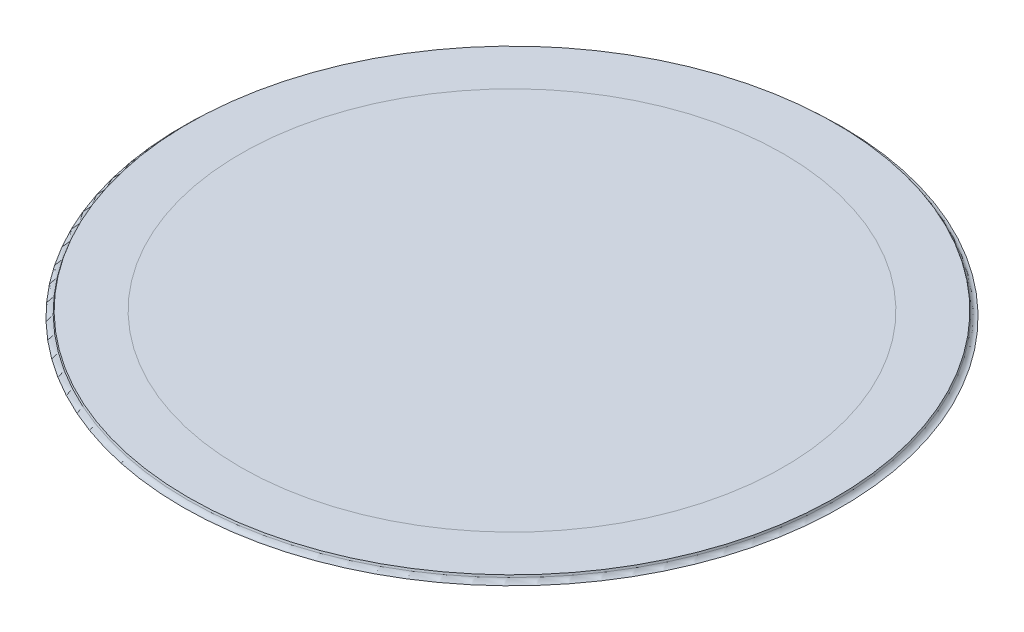
ISO-10303-21;
HEADER;
FILE_DESCRIPTION(('STEP AP214'),'2;1');
FILE_NAME('part.step','',(''),(''),'','','');
FILE_SCHEMA(('AUTOMOTIVE_DESIGN { 1 0 10303 214 1 1 1 1 }'));
ENDSEC;
DATA;
#1=APPLICATION_CONTEXT('core data for automotive mechanical design processes');
#2=APPLICATION_PROTOCOL_DEFINITION('international standard','automotive_design',2000,#1);
#3=PRODUCT_CONTEXT('',#1,'mechanical');
#4=PRODUCT('Part','Part','',(#3));
#5=PRODUCT_RELATED_PRODUCT_CATEGORY('part','',(#4));
#6=PRODUCT_DEFINITION_FORMATION('','',#4);
#7=PRODUCT_DEFINITION_CONTEXT('part definition',#1,'design');
#8=PRODUCT_DEFINITION('design','',#6,#7);
#9=PRODUCT_DEFINITION_SHAPE('','',#8);
#10=(LENGTH_UNIT() NAMED_UNIT(*) SI_UNIT(.MILLI.,.METRE.));
#11=(NAMED_UNIT(*) PLANE_ANGLE_UNIT() SI_UNIT($,.RADIAN.));
#12=(NAMED_UNIT(*) SI_UNIT($,.STERADIAN.) SOLID_ANGLE_UNIT());
#13=UNCERTAINTY_MEASURE_WITH_UNIT(LENGTH_MEASURE(1.E-05),#10,'distance_accuracy_value','');
#14=(GEOMETRIC_REPRESENTATION_CONTEXT(3) GLOBAL_UNCERTAINTY_ASSIGNED_CONTEXT((#13)) GLOBAL_UNIT_ASSIGNED_CONTEXT((#10,
#11,#12)) REPRESENTATION_CONTEXT('',''));
#15=CARTESIAN_POINT('',(0.,0.,0.));
#16=DIRECTION('',(0.,0.,1.));
#17=DIRECTION('',(1.,0.,0.));
#18=AXIS2_PLACEMENT_3D('',#15,#16,#17);
#19=CARTESIAN_POINT('',(0.,0.,35.));
#20=DIRECTION('',(0.,1.,0.));
#21=DIRECTION('',(0.,0.,1.));
#22=AXIS2_PLACEMENT_3D('',#19,#20,#21);
#23=PLANE('',#22);
#24=CARTESIAN_POINT('',(0.,0.,0.));
#25=DIRECTION('',(0.,1.,0.));
#26=DIRECTION('',(0.,0.,1.));
#27=AXIS2_PLACEMENT_3D('',#24,#25,#26);
#28=CIRCLE('',#27,30.3501037691049);
#29=CARTESIAN_POINT('',(0.,0.,30.3501037691049));
#30=VERTEX_POINT('',#29);
#31=EDGE_CURVE('E11',#30,#30,#28,.F.);
#32=ORIENTED_EDGE('',*,*,#31,.T.);
#33=EDGE_LOOP('',(#32));
#34=FACE_BOUND('',#33,.T.);
#35=ADVANCED_FACE('F40',(#34),#23,.F.);
#36=CARTESIAN_POINT('',(0.,0.5,0.));
#37=DIRECTION('',(0.,1.,0.));
#38=DIRECTION('',(0.,0.,1.));
#39=AXIS2_PLACEMENT_3D('',#36,#37,#38);
#40=PLANE('',#39);
#41=CARTESIAN_POINT('',(0.,0.5,0.));
#42=DIRECTION('',(0.,1.,0.));
#43=DIRECTION('',(0.,0.,1.));
#44=AXIS2_PLACEMENT_3D('',#41,#42,#43);
#45=CIRCLE('',#44,25.);
#46=CARTESIAN_POINT('',(0.,0.5,25.));
#47=VERTEX_POINT('',#46);
#48=EDGE_CURVE('E43',#47,#47,#45,.F.);
#49=ORIENTED_EDGE('',*,*,#48,.F.);
#50=EDGE_LOOP('',(#49));
#51=FACE_BOUND('',#50,.T.);
#52=ADVANCED_FACE('F72',(#51),#40,.T.);
#53=CARTESIAN_POINT('',(0.,0.5,0.));
#54=DIRECTION('',(0.,1.,0.));
#55=DIRECTION('',(0.,0.,1.));
#56=AXIS2_PLACEMENT_3D('',#53,#54,#55);
#57=CIRCLE('',#56,29.8180148828669);
#58=CARTESIAN_POINT('',(0.,0.5,29.8180148828669));
#59=VERTEX_POINT('',#58);
#60=EDGE_CURVE('E55',#59,#59,#57,.T.);
#61=ORIENTED_EDGE('',*,*,#60,.T.);
#62=EDGE_LOOP('',(#61));
#63=FACE_BOUND('',#62,.T.);
#64=ORIENTED_EDGE('',*,*,#48,.T.);
#65=EDGE_LOOP('',(#64));
#66=FACE_BOUND('',#65,.T.);
#67=ADVANCED_FACE('F59',(#63,#66),#40,.T.);
#68=CARTESIAN_POINT('',(0.,0.,0.));
#69=DIRECTION('',(0.,-1.,0.));
#70=DIRECTION('',(0.,0.,1.));
#71=AXIS2_PLACEMENT_3D('',#68,#69,#70);
#72=CONICAL_SURFACE('',#71,30.,0.349065850398867);
#73=CARTESIAN_POINT('',(0.,0.328989928337173,0.));
#74=DIRECTION('',(0.,1.,0.));
#75=DIRECTION('',(0.,0.,1.));
#76=AXIS2_PLACEMENT_3D('',#73,#74,#75);
#77=CIRCLE('',#76,29.8802574587119);
#78=CARTESIAN_POINT('',(0.,0.328989928337173,29.8802574587119));
#79=VERTEX_POINT('',#78);
#80=EDGE_CURVE('E51',#79,#79,#77,.T.);
#81=ORIENTED_EDGE('',*,*,#80,.T.);
#82=EDGE_LOOP('',(#81));
#83=FACE_BOUND('',#82,.T.);
#84=ORIENTED_EDGE('',*,*,#60,.F.);
#85=EDGE_LOOP('',(#84));
#86=FACE_BOUND('',#85,.T.);
#87=ADVANCED_FACE('F62',(#83,#86),#72,.T.);
#88=CARTESIAN_POINT('',(0.,0.5,0.));
#89=DIRECTION('',(0.,1.,0.));
#90=DIRECTION('',(0.,0.,1.));
#91=AXIS2_PLACEMENT_3D('',#88,#89,#90);
#92=TOROIDAL_SURFACE('',#91,30.3501037691049,0.5);
#93=ORIENTED_EDGE('',*,*,#31,.F.);
#94=EDGE_LOOP('',(#93));
#95=FACE_BOUND('',#94,.T.);
#96=ORIENTED_EDGE('',*,*,#80,.F.);
#97=EDGE_LOOP('',(#96));
#98=FACE_BOUND('',#97,.T.);
#99=ADVANCED_FACE('F64',(#95,#98),#92,.F.);
#100=CLOSED_SHELL('',(#35,#52,#67,#87,#99));
#101=MANIFOLD_SOLID_BREP('B2',#100);
#102=ADVANCED_BREP_SHAPE_REPRESENTATION('',(#18,#101),#14);
#103=SHAPE_DEFINITION_REPRESENTATION(#9,#102);
ENDSEC;
END-ISO-10303-21;
